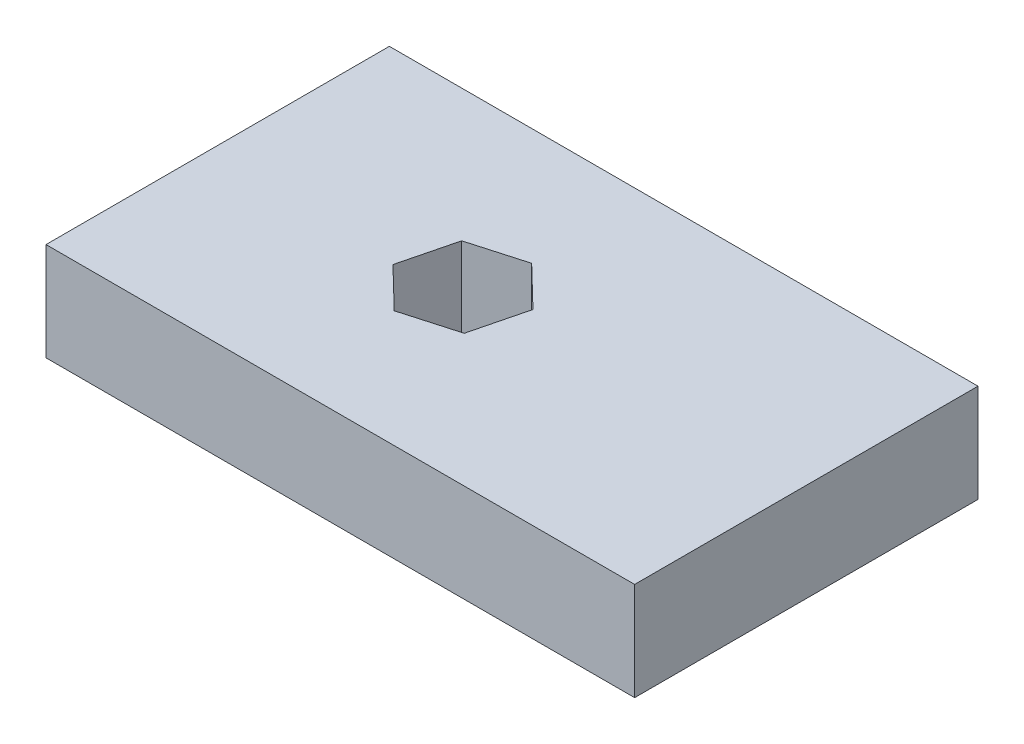
ISO-10303-21;
HEADER;
FILE_DESCRIPTION(('STEP AP214'),'2;1');
FILE_NAME('part.step','',(''),(''),'','','');
FILE_SCHEMA(('AUTOMOTIVE_DESIGN { 1 0 10303 214 1 1 1 1 }'));
ENDSEC;
DATA;
#1=APPLICATION_CONTEXT('core data for automotive mechanical design processes');
#2=APPLICATION_PROTOCOL_DEFINITION('international standard','automotive_design',2000,#1);
#3=PRODUCT_CONTEXT('',#1,'mechanical');
#4=PRODUCT('Part','Part','',(#3));
#5=PRODUCT_RELATED_PRODUCT_CATEGORY('part','',(#4));
#6=PRODUCT_DEFINITION_FORMATION('','',#4);
#7=PRODUCT_DEFINITION_CONTEXT('part definition',#1,'design');
#8=PRODUCT_DEFINITION('design','',#6,#7);
#9=PRODUCT_DEFINITION_SHAPE('','',#8);
#10=(LENGTH_UNIT() NAMED_UNIT(*) SI_UNIT(.MILLI.,.METRE.));
#11=(NAMED_UNIT(*) PLANE_ANGLE_UNIT() SI_UNIT($,.RADIAN.));
#12=(NAMED_UNIT(*) SI_UNIT($,.STERADIAN.) SOLID_ANGLE_UNIT());
#13=UNCERTAINTY_MEASURE_WITH_UNIT(LENGTH_MEASURE(1.E-05),#10,'distance_accuracy_value','');
#14=(GEOMETRIC_REPRESENTATION_CONTEXT(3) GLOBAL_UNCERTAINTY_ASSIGNED_CONTEXT((#13)) GLOBAL_UNIT_ASSIGNED_CONTEXT((#10,
#11,#12)) REPRESENTATION_CONTEXT('',''));
#15=CARTESIAN_POINT('',(0.,0.,0.));
#16=DIRECTION('',(0.,0.,1.));
#17=DIRECTION('',(1.,0.,0.));
#18=AXIS2_PLACEMENT_3D('',#15,#16,#17);
#19=CARTESIAN_POINT('',(-29.3835910500665,12.7,-16.1144262295082));
#20=DIRECTION('',(1.,0.,0.));
#21=DIRECTION('',(0.,0.,-1.));
#22=AXIS2_PLACEMENT_3D('',#19,#20,#21);
#23=PLANE('',#22);
#24=DIRECTION('',(0.,0.,1.));
#25=VECTOR('',#24,1.);
#26=CARTESIAN_POINT('',(-29.3835910500665,0.,-16.1144262295082));
#27=LINE('',#26,#25);
#28=CARTESIAN_POINT('',(-29.3835910500665,0.,-16.1144262295082));
#29=VERTEX_POINT('',#28);
#30=CARTESIAN_POINT('',(-29.3835910500664,0.,28.3355737704918));
#31=VERTEX_POINT('',#30);
#32=EDGE_CURVE('E155',#29,#31,#27,.T.);
#33=ORIENTED_EDGE('',*,*,#32,.T.);
#34=DIRECTION('',(0.,-1.,0.));
#35=VECTOR('',#34,1.);
#36=CARTESIAN_POINT('',(-29.3835910500664,12.7,28.3355737704918));
#37=LINE('',#36,#35);
#38=CARTESIAN_POINT('',(-29.3835910500664,12.7,28.3355737704918));
#39=VERTEX_POINT('',#38);
#40=EDGE_CURVE('E203',#39,#31,#37,.T.);
#41=ORIENTED_EDGE('',*,*,#40,.F.);
#42=DIRECTION('',(0.,0.,1.));
#43=VECTOR('',#42,1.);
#44=CARTESIAN_POINT('',(-29.3835910500665,12.7,-16.1144262295082));
#45=LINE('',#44,#43);
#46=CARTESIAN_POINT('',(-29.3835910500665,12.7,-16.1144262295082));
#47=VERTEX_POINT('',#46);
#48=EDGE_CURVE('E166',#47,#39,#45,.T.);
#49=ORIENTED_EDGE('',*,*,#48,.F.);
#50=DIRECTION('',(0.,-1.,0.));
#51=VECTOR('',#50,1.);
#52=CARTESIAN_POINT('',(-29.3835910500665,12.7,-16.1144262295082));
#53=LINE('',#52,#51);
#54=EDGE_CURVE('E180',#47,#29,#53,.T.);
#55=ORIENTED_EDGE('',*,*,#54,.T.);
#56=EDGE_LOOP('',(#33,#41,#49,#55));
#57=FACE_BOUND('',#56,.T.);
#58=ADVANCED_FACE('F38',(#57),#23,.F.);
#59=CARTESIAN_POINT('',(-29.3835910500664,12.7,28.3355737704918));
#60=DIRECTION('',(0.,0.,-1.));
#61=DIRECTION('',(-1.,0.,0.));
#62=AXIS2_PLACEMENT_3D('',#59,#60,#61);
#63=PLANE('',#62);
#64=DIRECTION('',(1.,0.,0.));
#65=VECTOR('',#64,1.);
#66=CARTESIAN_POINT('',(-29.3835910500664,0.,28.3355737704918));
#67=LINE('',#66,#65);
#68=CARTESIAN_POINT('',(46.8164089499335,0.,28.3355737704918));
#69=VERTEX_POINT('',#68);
#70=EDGE_CURVE('E184',#31,#69,#67,.T.);
#71=ORIENTED_EDGE('',*,*,#70,.T.);
#72=DIRECTION('',(0.,-1.,0.));
#73=VECTOR('',#72,1.);
#74=CARTESIAN_POINT('',(46.8164089499335,12.7,28.3355737704918));
#75=LINE('',#74,#73);
#76=CARTESIAN_POINT('',(46.8164089499335,12.7,28.3355737704918));
#77=VERTEX_POINT('',#76);
#78=EDGE_CURVE('E199',#77,#69,#75,.T.);
#79=ORIENTED_EDGE('',*,*,#78,.F.);
#80=DIRECTION('',(1.,0.,0.));
#81=VECTOR('',#80,1.);
#82=CARTESIAN_POINT('',(-29.3835910500664,12.7,28.3355737704918));
#83=LINE('',#82,#81);
#84=EDGE_CURVE('E170',#39,#77,#83,.T.);
#85=ORIENTED_EDGE('',*,*,#84,.F.);
#86=ORIENTED_EDGE('',*,*,#40,.T.);
#87=EDGE_LOOP('',(#71,#79,#85,#86));
#88=FACE_BOUND('',#87,.T.);
#89=ADVANCED_FACE('F248',(#88),#63,.F.);
#90=CARTESIAN_POINT('',(46.8164089499336,12.7,-16.1144262295082));
#91=DIRECTION('',(-1.,0.,0.));
#92=DIRECTION('',(0.,0.,1.));
#93=AXIS2_PLACEMENT_3D('',#90,#91,#92);
#94=PLANE('',#93);
#95=DIRECTION('',(0.,0.,-1.));
#96=VECTOR('',#95,1.);
#97=CARTESIAN_POINT('',(46.8164089499336,0.,-16.1144262295082));
#98=LINE('',#97,#96);
#99=CARTESIAN_POINT('',(46.8164089499336,0.,-16.1144262295082));
#100=VERTEX_POINT('',#99);
#101=EDGE_CURVE('E187',#69,#100,#98,.T.);
#102=ORIENTED_EDGE('',*,*,#101,.T.);
#103=DIRECTION('',(0.,-1.,0.));
#104=VECTOR('',#103,1.);
#105=CARTESIAN_POINT('',(46.8164089499336,12.7,-16.1144262295082));
#106=LINE('',#105,#104);
#107=CARTESIAN_POINT('',(46.8164089499336,12.7,-16.1144262295082));
#108=VERTEX_POINT('',#107);
#109=EDGE_CURVE('E195',#108,#100,#106,.T.);
#110=ORIENTED_EDGE('',*,*,#109,.F.);
#111=DIRECTION('',(0.,0.,-1.));
#112=VECTOR('',#111,1.);
#113=CARTESIAN_POINT('',(46.8164089499336,12.7,-16.1144262295082));
#114=LINE('',#113,#112);
#115=EDGE_CURVE('E174',#77,#108,#114,.T.);
#116=ORIENTED_EDGE('',*,*,#115,.F.);
#117=ORIENTED_EDGE('',*,*,#78,.T.);
#118=EDGE_LOOP('',(#102,#110,#116,#117));
#119=FACE_BOUND('',#118,.T.);
#120=ADVANCED_FACE('F253',(#119),#94,.F.);
#121=CARTESIAN_POINT('',(-29.3835910500665,12.7,-16.1144262295082));
#122=DIRECTION('',(0.,0.,1.));
#123=DIRECTION('',(1.,0.,0.));
#124=AXIS2_PLACEMENT_3D('',#121,#122,#123);
#125=PLANE('',#124);
#126=DIRECTION('',(-1.,0.,0.));
#127=VECTOR('',#126,1.);
#128=CARTESIAN_POINT('',(-29.3835910500665,0.,-16.1144262295082));
#129=LINE('',#128,#127);
#130=EDGE_CURVE('E171',#100,#29,#129,.T.);
#131=ORIENTED_EDGE('',*,*,#130,.T.);
#132=ORIENTED_EDGE('',*,*,#54,.F.);
#133=DIRECTION('',(-1.,0.,0.));
#134=VECTOR('',#133,1.);
#135=CARTESIAN_POINT('',(-29.3835910500665,12.7,-16.1144262295082));
#136=LINE('',#135,#134);
#137=EDGE_CURVE('E177',#108,#47,#136,.T.);
#138=ORIENTED_EDGE('',*,*,#137,.F.);
#139=ORIENTED_EDGE('',*,*,#109,.T.);
#140=EDGE_LOOP('',(#131,#132,#138,#139));
#141=FACE_BOUND('',#140,.T.);
#142=ADVANCED_FACE('F266',(#141),#125,.F.);
#143=CARTESIAN_POINT('',(0.,12.7,0.));
#144=DIRECTION('',(0.,1.,0.));
#145=DIRECTION('',(0.,0.,1.));
#146=AXIS2_PLACEMENT_3D('',#143,#144,#145);
#147=PLANE('',#146);
#148=DIRECTION('',(-0.718407070153674,0.,-0.695622944958844));
#149=VECTOR('',#148,1.);
#150=CARTESIAN_POINT('',(9.41742012283725,12.7,4.09896377525904));
#151=LINE('',#150,#149);
#152=CARTESIAN_POINT('',(9.41742012283725,12.7,4.09896377525904));
#153=VERTEX_POINT('',#152);
#154=CARTESIAN_POINT('',(4.14980917800713,12.7,-1.00158602522711));
#155=VERTEX_POINT('',#154);
#156=EDGE_CURVE('E53',#153,#155,#151,.T.);
#157=ORIENTED_EDGE('',*,*,#156,.F.);
#158=DIRECTION('',(0.243223606712866,0.,-0.969970245490853));
#159=VECTOR('',#158,1.);
#160=CARTESIAN_POINT('',(7.63401989476365,12.7,11.211123570978));
#161=LINE('',#160,#159);
#162=CARTESIAN_POINT('',(7.63401989476365,12.7,11.211123570978));
#163=VERTEX_POINT('',#162);
#164=EDGE_CURVE('E148',#163,#153,#161,.T.);
#165=ORIENTED_EDGE('',*,*,#164,.F.);
#166=DIRECTION('',(0.96163067686654,0.,-0.274347300532009));
#167=VECTOR('',#166,1.);
#168=CARTESIAN_POINT('',(0.583008721859936,12.7,13.2227335662107));
#169=LINE('',#168,#167);
#170=CARTESIAN_POINT('',(0.583008721859936,12.7,13.2227335662107));
#171=VERTEX_POINT('',#170);
#172=EDGE_CURVE('E141',#171,#163,#169,.T.);
#173=ORIENTED_EDGE('',*,*,#172,.F.);
#174=DIRECTION('',(0.718407070153674,0.,0.695622944958844));
#175=VECTOR('',#174,1.);
#176=CARTESIAN_POINT('',(-4.68460222297018,12.7,8.12218376572455));
#177=LINE('',#176,#175);
#178=CARTESIAN_POINT('',(-4.68460222297018,12.7,8.12218376572455));
#179=VERTEX_POINT('',#178);
#180=EDGE_CURVE('E137',#179,#171,#177,.T.);
#181=ORIENTED_EDGE('',*,*,#180,.F.);
#182=DIRECTION('',(-0.243223606712866,0.,0.969970245490853));
#183=VECTOR('',#182,1.);
#184=CARTESIAN_POINT('',(-2.90120199489658,12.7,1.01002397000564));
#185=LINE('',#184,#183);
#186=CARTESIAN_POINT('',(-2.90120199489658,12.7,1.01002397000564));
#187=VERTEX_POINT('',#186);
#188=EDGE_CURVE('E118',#187,#179,#185,.T.);
#189=ORIENTED_EDGE('',*,*,#188,.F.);
#190=DIRECTION('',(-0.96163067686654,0.,0.274347300532009));
#191=VECTOR('',#190,1.);
#192=CARTESIAN_POINT('',(4.14980917800713,12.7,-1.00158602522711));
#193=LINE('',#192,#191);
#194=EDGE_CURVE('E128',#155,#187,#193,.T.);
#195=ORIENTED_EDGE('',*,*,#194,.F.);
#196=EDGE_LOOP('',(#157,#165,#173,#181,#189,#195));
#197=FACE_BOUND('',#196,.T.);
#198=ORIENTED_EDGE('',*,*,#48,.T.);
#199=ORIENTED_EDGE('',*,*,#84,.T.);
#200=ORIENTED_EDGE('',*,*,#115,.T.);
#201=ORIENTED_EDGE('',*,*,#137,.T.);
#202=EDGE_LOOP('',(#198,#199,#200,#201));
#203=FACE_BOUND('',#202,.T.);
#204=ADVANCED_FACE('F133',(#197,#203),#147,.T.);
#205=CARTESIAN_POINT('',(0.,0.,0.));
#206=DIRECTION('',(0.,1.,0.));
#207=DIRECTION('',(0.,0.,1.));
#208=AXIS2_PLACEMENT_3D('',#205,#206,#207);
#209=PLANE('',#208);
#210=DIRECTION('',(0.243223606712866,0.,-0.969970245490853));
#211=VECTOR('',#210,1.);
#212=CARTESIAN_POINT('',(9.82733313954242,0.,2.46423993074014));
#213=LINE('',#212,#211);
#214=CARTESIAN_POINT('',(7.63401989476365,0.,11.211123570978));
#215=VERTEX_POINT('',#214);
#216=CARTESIAN_POINT('',(9.41742012283725,0.,4.09896377525904));
#217=VERTEX_POINT('',#216);
#218=EDGE_CURVE('E46',#215,#217,#213,.T.);
#219=ORIENTED_EDGE('',*,*,#218,.T.);
#220=DIRECTION('',(-0.718407070153674,0.,-0.695622944958844));
#221=VECTOR('',#220,1.);
#222=CARTESIAN_POINT('',(2.50858952411445,0.,-2.5907547519783));
#223=LINE('',#222,#221);
#224=CARTESIAN_POINT('',(4.14980917800713,0.,-1.00158602522711));
#225=VERTEX_POINT('',#224);
#226=EDGE_CURVE('E11',#217,#225,#223,.T.);
#227=ORIENTED_EDGE('',*,*,#226,.T.);
#228=DIRECTION('',(-0.96163067686654,0.,0.274347300532009));
#229=VECTOR('',#228,1.);
#230=CARTESIAN_POINT('',(0.0481021622207477,0.,0.168605686024182));
#231=LINE('',#230,#229);
#232=CARTESIAN_POINT('',(-2.90120199489658,0.,1.01002397000564));
#233=VERTEX_POINT('',#232);
#234=EDGE_CURVE('E207',#225,#233,#231,.T.);
#235=ORIENTED_EDGE('',*,*,#234,.T.);
#236=DIRECTION('',(-0.243223606712866,0.,0.969970245490853));
#237=VECTOR('',#236,1.);
#238=CARTESIAN_POINT('',(-2.49128897819141,0.,-0.624699874513255));
#239=LINE('',#238,#237);
#240=CARTESIAN_POINT('',(-4.68460222297018,0.,8.12218376572455));
#241=VERTEX_POINT('',#240);
#242=EDGE_CURVE('E121',#233,#241,#239,.T.);
#243=ORIENTED_EDGE('',*,*,#242,.T.);
#244=DIRECTION('',(0.718407070153674,0.,0.695622944958844));
#245=VECTOR('',#244,1.);
#246=CARTESIAN_POINT('',(-6.32582187686287,0.,6.53301503897337));
#247=LINE('',#246,#245);
#248=CARTESIAN_POINT('',(0.583008721859936,0.,13.2227335662107));
#249=VERTEX_POINT('',#248);
#250=EDGE_CURVE('E212',#241,#249,#247,.T.);
#251=ORIENTED_EDGE('',*,*,#250,.T.);
#252=DIRECTION('',(0.96163067686654,0.,-0.274347300532009));
#253=VECTOR('',#252,1.);
#254=CARTESIAN_POINT('',(3.53231287897726,0.,12.3813152822293));
#255=LINE('',#254,#253);
#256=EDGE_CURVE('E216',#249,#215,#255,.T.);
#257=ORIENTED_EDGE('',*,*,#256,.T.);
#258=EDGE_LOOP('',(#219,#227,#235,#243,#251,#257));
#259=FACE_BOUND('',#258,.T.);
#260=ORIENTED_EDGE('',*,*,#32,.F.);
#261=ORIENTED_EDGE('',*,*,#130,.F.);
#262=ORIENTED_EDGE('',*,*,#101,.F.);
#263=ORIENTED_EDGE('',*,*,#70,.F.);
#264=EDGE_LOOP('',(#260,#261,#262,#263));
#265=FACE_BOUND('',#264,.T.);
#266=ADVANCED_FACE('F222',(#259,#265),#209,.F.);
#267=CARTESIAN_POINT('',(9.41742012283725,-6.85800000000001,4.09896377525904));
#268=DIRECTION('',(0.695622944958844,0.,-0.718407070153674));
#269=DIRECTION('',(-0.718407070153674,0.,-0.695622944958844));
#270=AXIS2_PLACEMENT_3D('',#267,#268,#269);
#271=PLANE('',#270);
#272=DIRECTION('',(0.,1.,0.));
#273=VECTOR('',#272,1.);
#274=CARTESIAN_POINT('',(9.41742012283725,-6.85800000000001,4.09896377525904));
#275=LINE('',#274,#273);
#276=EDGE_CURVE('E152',#217,#153,#275,.T.);
#277=ORIENTED_EDGE('',*,*,#276,.T.);
#278=ORIENTED_EDGE('',*,*,#156,.T.);
#279=DIRECTION('',(0.,1.,0.));
#280=VECTOR('',#279,1.);
#281=CARTESIAN_POINT('',(4.14980917800713,-6.85800000000001,-1.00158602522711));
#282=LINE('',#281,#280);
#283=EDGE_CURVE('E125',#225,#155,#282,.T.);
#284=ORIENTED_EDGE('',*,*,#283,.F.);
#285=ORIENTED_EDGE('',*,*,#226,.F.);
#286=EDGE_LOOP('',(#277,#278,#284,#285));
#287=FACE_BOUND('',#286,.T.);
#288=ADVANCED_FACE('F235',(#287),#271,.F.);
#289=CARTESIAN_POINT('',(7.63401989476365,-6.85800000000001,11.211123570978));
#290=DIRECTION('',(0.969970245490853,0.,0.243223606712866));
#291=DIRECTION('',(0.243223606712866,0.,-0.969970245490853));
#292=AXIS2_PLACEMENT_3D('',#289,#290,#291);
#293=PLANE('',#292);
#294=DIRECTION('',(0.,1.,0.));
#295=VECTOR('',#294,1.);
#296=CARTESIAN_POINT('',(7.63401989476365,-6.85800000000001,11.211123570978));
#297=LINE('',#296,#295);
#298=EDGE_CURVE('E156',#215,#163,#297,.T.);
#299=ORIENTED_EDGE('',*,*,#298,.T.);
#300=ORIENTED_EDGE('',*,*,#164,.T.);
#301=ORIENTED_EDGE('',*,*,#276,.F.);
#302=ORIENTED_EDGE('',*,*,#218,.F.);
#303=EDGE_LOOP('',(#299,#300,#301,#302));
#304=FACE_BOUND('',#303,.T.);
#305=ADVANCED_FACE('F227',(#304),#293,.F.);
#306=CARTESIAN_POINT('',(0.583008721859936,-6.85800000000001,13.2227335662107));
#307=DIRECTION('',(0.274347300532009,0.,0.96163067686654));
#308=DIRECTION('',(0.96163067686654,0.,-0.274347300532009));
#309=AXIS2_PLACEMENT_3D('',#306,#307,#308);
#310=PLANE('',#309);
#311=DIRECTION('',(0.,1.,0.));
#312=VECTOR('',#311,1.);
#313=CARTESIAN_POINT('',(0.583008721859936,-6.85800000000001,13.2227335662107));
#314=LINE('',#313,#312);
#315=EDGE_CURVE('E159',#249,#171,#314,.T.);
#316=ORIENTED_EDGE('',*,*,#315,.T.);
#317=ORIENTED_EDGE('',*,*,#172,.T.);
#318=ORIENTED_EDGE('',*,*,#298,.F.);
#319=ORIENTED_EDGE('',*,*,#256,.F.);
#320=EDGE_LOOP('',(#316,#317,#318,#319));
#321=FACE_BOUND('',#320,.T.);
#322=ADVANCED_FACE('F229',(#321),#310,.F.);
#323=CARTESIAN_POINT('',(-4.68460222297018,-6.85800000000001,8.12218376572455));
#324=DIRECTION('',(-0.695622944958844,0.,0.718407070153674));
#325=DIRECTION('',(0.718407070153674,0.,0.695622944958844));
#326=AXIS2_PLACEMENT_3D('',#323,#324,#325);
#327=PLANE('',#326);
#328=DIRECTION('',(0.,1.,0.));
#329=VECTOR('',#328,1.);
#330=CARTESIAN_POINT('',(-4.68460222297018,-6.85800000000001,8.12218376572455));
#331=LINE('',#330,#329);
#332=EDGE_CURVE('E124',#241,#179,#331,.T.);
#333=ORIENTED_EDGE('',*,*,#332,.T.);
#334=ORIENTED_EDGE('',*,*,#180,.T.);
#335=ORIENTED_EDGE('',*,*,#315,.F.);
#336=ORIENTED_EDGE('',*,*,#250,.F.);
#337=EDGE_LOOP('',(#333,#334,#335,#336));
#338=FACE_BOUND('',#337,.T.);
#339=ADVANCED_FACE('F234',(#338),#327,.F.);
#340=CARTESIAN_POINT('',(-2.90120199489658,-6.85800000000001,1.01002397000564));
#341=DIRECTION('',(-0.969970245490853,0.,-0.243223606712866));
#342=DIRECTION('',(-0.243223606712866,0.,0.969970245490853));
#343=AXIS2_PLACEMENT_3D('',#340,#341,#342);
#344=PLANE('',#343);
#345=DIRECTION('',(0.,1.,0.));
#346=VECTOR('',#345,1.);
#347=CARTESIAN_POINT('',(-2.90120199489658,-6.85800000000001,1.01002397000564));
#348=LINE('',#347,#346);
#349=EDGE_CURVE('E61',#233,#187,#348,.T.);
#350=ORIENTED_EDGE('',*,*,#349,.T.);
#351=ORIENTED_EDGE('',*,*,#188,.T.);
#352=ORIENTED_EDGE('',*,*,#332,.F.);
#353=ORIENTED_EDGE('',*,*,#242,.F.);
#354=EDGE_LOOP('',(#350,#351,#352,#353));
#355=FACE_BOUND('',#354,.T.);
#356=ADVANCED_FACE('F115',(#355),#344,.F.);
#357=CARTESIAN_POINT('',(4.14980917800713,-6.85800000000001,-1.00158602522711));
#358=DIRECTION('',(-0.274347300532009,0.,-0.96163067686654));
#359=DIRECTION('',(-0.96163067686654,0.,0.274347300532009));
#360=AXIS2_PLACEMENT_3D('',#357,#358,#359);
#361=PLANE('',#360);
#362=ORIENTED_EDGE('',*,*,#283,.T.);
#363=ORIENTED_EDGE('',*,*,#194,.T.);
#364=ORIENTED_EDGE('',*,*,#349,.F.);
#365=ORIENTED_EDGE('',*,*,#234,.F.);
#366=EDGE_LOOP('',(#362,#363,#364,#365));
#367=FACE_BOUND('',#366,.T.);
#368=ADVANCED_FACE('F129',(#367),#361,.F.);
#369=CLOSED_SHELL('',(#58,#89,#120,#142,#204,#266,#288,#305,#322,#339,#356,#368));
#370=MANIFOLD_SOLID_BREP('B2',#369);
#371=ADVANCED_BREP_SHAPE_REPRESENTATION('',(#18,#370),#14);
#372=SHAPE_DEFINITION_REPRESENTATION(#9,#371);
ENDSEC;
END-ISO-10303-21;
